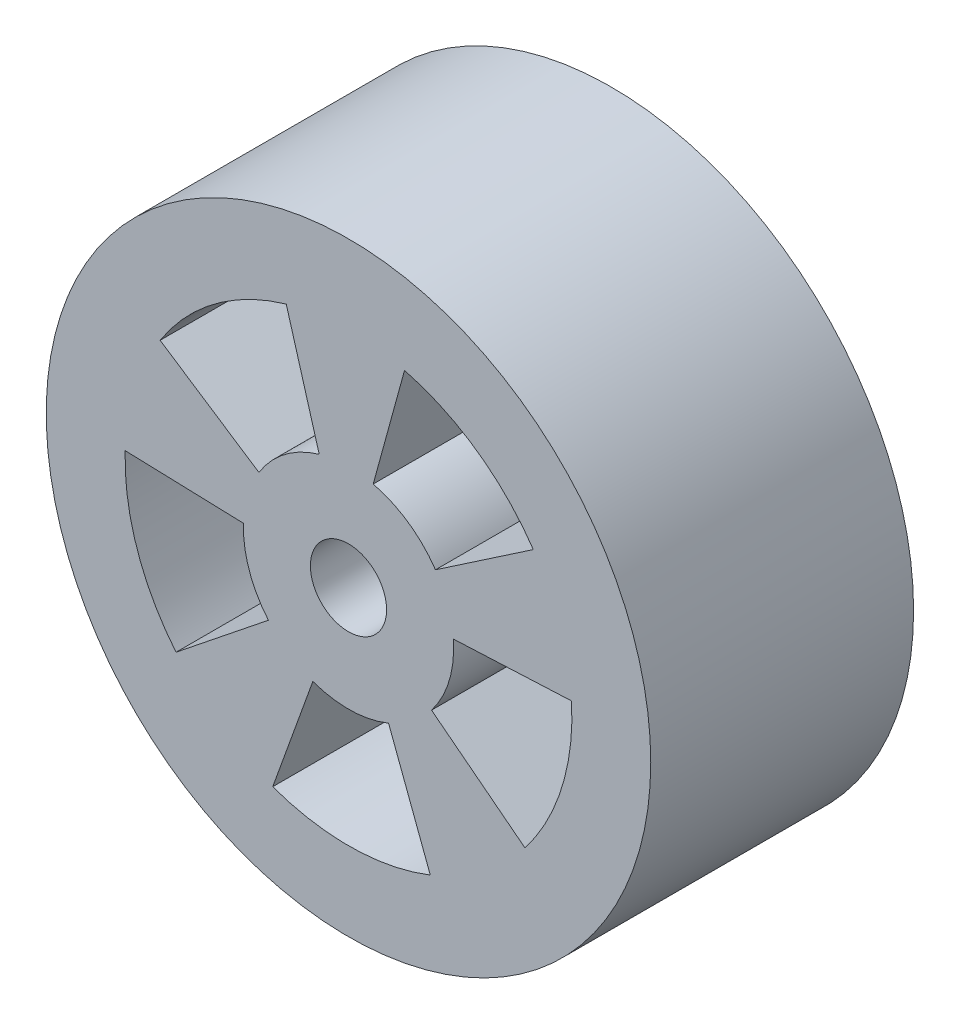
ISO-10303-21;
HEADER;
FILE_DESCRIPTION(('STEP AP214'),'2;1');
FILE_NAME('part.step','',(''),(''),'','','');
FILE_SCHEMA(('AUTOMOTIVE_DESIGN { 1 0 10303 214 1 1 1 1 }'));
ENDSEC;
DATA;
#1=APPLICATION_CONTEXT('core data for automotive mechanical design processes');
#2=APPLICATION_PROTOCOL_DEFINITION('international standard','automotive_design',2000,#1);
#3=PRODUCT_CONTEXT('',#1,'mechanical');
#4=PRODUCT('Part','Part','',(#3));
#5=PRODUCT_RELATED_PRODUCT_CATEGORY('part','',(#4));
#6=PRODUCT_DEFINITION_FORMATION('','',#4);
#7=PRODUCT_DEFINITION_CONTEXT('part definition',#1,'design');
#8=PRODUCT_DEFINITION('design','',#6,#7);
#9=PRODUCT_DEFINITION_SHAPE('','',#8);
#10=(LENGTH_UNIT() NAMED_UNIT(*) SI_UNIT(.MILLI.,.METRE.));
#11=(NAMED_UNIT(*) PLANE_ANGLE_UNIT() SI_UNIT($,.RADIAN.));
#12=(NAMED_UNIT(*) SI_UNIT($,.STERADIAN.) SOLID_ANGLE_UNIT());
#13=UNCERTAINTY_MEASURE_WITH_UNIT(LENGTH_MEASURE(1.E-05),#10,'distance_accuracy_value','');
#14=(GEOMETRIC_REPRESENTATION_CONTEXT(3) GLOBAL_UNCERTAINTY_ASSIGNED_CONTEXT((#13)) GLOBAL_UNIT_ASSIGNED_CONTEXT((#10,
#11,#12)) REPRESENTATION_CONTEXT('',''));
#15=CARTESIAN_POINT('',(0.,0.,0.));
#16=DIRECTION('',(0.,0.,1.));
#17=DIRECTION('',(1.,0.,0.));
#18=AXIS2_PLACEMENT_3D('',#15,#16,#17);
#19=CARTESIAN_POINT('',(0.,0.,0.));
#20=DIRECTION('',(0.,0.,1.));
#21=DIRECTION('',(1.,0.,0.));
#22=AXIS2_PLACEMENT_3D('',#19,#20,#21);
#23=CYLINDRICAL_SURFACE('',#22,8.5);
#24=DIRECTION('',(0.,0.,-1.));
#25=VECTOR('',#24,1.);
#26=CARTESIAN_POINT('',(8.48437143384065,0.515210027686529,10.));
#27=LINE('',#26,#25);
#28=CARTESIAN_POINT('',(8.48437143384065,0.515210027686529,10.));
#29=VERTEX_POINT('',#28);
#30=CARTESIAN_POINT('',(8.48437143384065,0.515210027686529,0.));
#31=VERTEX_POINT('',#30);
#32=EDGE_CURVE('E184',#29,#31,#27,.T.);
#33=ORIENTED_EDGE('',*,*,#32,.T.);
#34=CARTESIAN_POINT('',(0.,0.,0.));
#35=DIRECTION('',(0.,0.,1.));
#36=DIRECTION('',(1.,0.,0.));
#37=AXIS2_PLACEMENT_3D('',#34,#35,#36);
#38=CIRCLE('',#37,8.5);
#39=CARTESIAN_POINT('',(6.71424575052621,-5.21237987885963,0.));
#40=VERTEX_POINT('',#39);
#41=EDGE_CURVE('E221',#40,#31,#38,.T.);
#42=ORIENTED_EDGE('',*,*,#41,.F.);
#43=DIRECTION('',(0.,0.,-1.));
#44=VECTOR('',#43,1.);
#45=CARTESIAN_POINT('',(6.71424575052621,-5.21237987885963,10.));
#46=LINE('',#45,#44);
#47=CARTESIAN_POINT('',(6.71424575052621,-5.21237987885963,10.));
#48=VERTEX_POINT('',#47);
#49=EDGE_CURVE('E195',#48,#40,#46,.T.);
#50=ORIENTED_EDGE('',*,*,#49,.F.);
#51=CARTESIAN_POINT('',(0.,0.,10.));
#52=DIRECTION('',(0.,0.,1.));
#53=DIRECTION('',(1.,0.,0.));
#54=AXIS2_PLACEMENT_3D('',#51,#52,#53);
#55=CIRCLE('',#54,8.5);
#56=EDGE_CURVE('E177',#48,#29,#55,.T.);
#57=ORIENTED_EDGE('',*,*,#56,.T.);
#58=EDGE_LOOP('',(#33,#42,#50,#57));
#59=FACE_BOUND('',#58,.T.);
#60=ADVANCED_FACE('F33',(#59),#23,.F.);
#61=DIRECTION('',(0.,0.,-1.));
#62=VECTOR('',#61,1.);
#63=CARTESIAN_POINT('',(7.03208389051756,4.77491320933936,10.));
#64=LINE('',#63,#62);
#65=CARTESIAN_POINT('',(7.03208389051756,4.77491320933936,10.));
#66=VERTEX_POINT('',#65);
#67=CARTESIAN_POINT('',(7.03208389051755,4.77491320933936,0.));
#68=VERTEX_POINT('',#67);
#69=EDGE_CURVE('E191',#66,#68,#64,.T.);
#70=ORIENTED_EDGE('',*,*,#69,.F.);
#71=CARTESIAN_POINT('',(2.13182110555429,8.22832539305012,10.));
#72=VERTEX_POINT('',#71);
#73=EDGE_CURVE('E197',#66,#72,#55,.T.);
#74=ORIENTED_EDGE('',*,*,#73,.T.);
#75=DIRECTION('',(0.,0.,-1.));
#76=VECTOR('',#75,1.);
#77=CARTESIAN_POINT('',(2.13182110555429,8.22832539305012,10.));
#78=LINE('',#77,#76);
#79=CARTESIAN_POINT('',(2.13182110555429,8.22832539305012,0.));
#80=VERTEX_POINT('',#79);
#81=EDGE_CURVE('E318',#72,#80,#78,.T.);
#82=ORIENTED_EDGE('',*,*,#81,.T.);
#83=EDGE_CURVE('E206',#68,#80,#38,.T.);
#84=ORIENTED_EDGE('',*,*,#83,.F.);
#85=EDGE_LOOP('',(#70,#74,#82,#84));
#86=FACE_BOUND('',#85,.T.);
#87=ADVANCED_FACE('F344',(#86),#23,.F.);
#88=CARTESIAN_POINT('',(0.,0.,10.));
#89=DIRECTION('',(0.,0.,-1.));
#90=DIRECTION('',(-1.,0.,0.));
#91=AXIS2_PLACEMENT_3D('',#88,#89,#90);
#92=CYLINDRICAL_SURFACE('',#91,4.);
#93=DIRECTION('',(0.,0.,-1.));
#94=VECTOR('',#93,1.);
#95=CARTESIAN_POINT('',(3.98819234617977,0.307118559961968,10.));
#96=LINE('',#95,#94);
#97=CARTESIAN_POINT('',(3.98819234617977,0.307118559961968,10.));
#98=VERTEX_POINT('',#97);
#99=CARTESIAN_POINT('',(3.98819234617977,0.307118559961968,0.));
#100=VERTEX_POINT('',#99);
#101=EDGE_CURVE('E56',#98,#100,#96,.T.);
#102=ORIENTED_EDGE('',*,*,#101,.F.);
#103=CARTESIAN_POINT('',(0.,0.,10.));
#104=DIRECTION('',(0.,0.,1.));
#105=DIRECTION('',(1.,0.,0.));
#106=AXIS2_PLACEMENT_3D('',#103,#104,#105);
#107=CIRCLE('',#106,4.);
#108=CARTESIAN_POINT('',(3.15964505907116,-2.45288464887512,10.));
#109=VERTEX_POINT('',#108);
#110=EDGE_CURVE('E178',#109,#98,#107,.T.);
#111=ORIENTED_EDGE('',*,*,#110,.F.);
#112=DIRECTION('',(0.,0.,-1.));
#113=VECTOR('',#112,1.);
#114=CARTESIAN_POINT('',(3.15964505907116,-2.45288464887512,10.));
#115=LINE('',#114,#113);
#116=CARTESIAN_POINT('',(3.15964505907116,-2.45288464887512,0.));
#117=VERTEX_POINT('',#116);
#118=EDGE_CURVE('E252',#109,#117,#115,.T.);
#119=ORIENTED_EDGE('',*,*,#118,.T.);
#120=CARTESIAN_POINT('',(0.,0.,0.));
#121=DIRECTION('',(0.,0.,1.));
#122=DIRECTION('',(1.,0.,0.));
#123=AXIS2_PLACEMENT_3D('',#120,#121,#122);
#124=CIRCLE('',#123,4.);
#125=EDGE_CURVE('E329',#117,#100,#124,.T.);
#126=ORIENTED_EDGE('',*,*,#125,.T.);
#127=EDGE_LOOP('',(#102,#111,#119,#126));
#128=FACE_BOUND('',#127,.T.);
#129=ADVANCED_FACE('F350',(#128),#92,.T.);
#130=DIRECTION('',(0.,0.,-1.));
#131=VECTOR('',#130,1.);
#132=CARTESIAN_POINT('',(3.30921594847885,2.24701798086558,10.));
#133=LINE('',#132,#131);
#134=CARTESIAN_POINT('',(3.30921594847885,2.24701798086558,10.));
#135=VERTEX_POINT('',#134);
#136=CARTESIAN_POINT('',(3.30921594847885,2.24701798086558,0.));
#137=VERTEX_POINT('',#136);
#138=EDGE_CURVE('E327',#135,#137,#133,.T.);
#139=ORIENTED_EDGE('',*,*,#138,.T.);
#140=CARTESIAN_POINT('',(0.940332104078659,3.88790117338893,0.));
#141=VERTEX_POINT('',#140);
#142=EDGE_CURVE('E295',#137,#141,#124,.T.);
#143=ORIENTED_EDGE('',*,*,#142,.T.);
#144=DIRECTION('',(0.,0.,-1.));
#145=VECTOR('',#144,1.);
#146=CARTESIAN_POINT('',(0.940332104078659,3.88790117338893,10.));
#147=LINE('',#146,#145);
#148=CARTESIAN_POINT('',(0.940332104078659,3.88790117338893,10.));
#149=VERTEX_POINT('',#148);
#150=EDGE_CURVE('E201',#149,#141,#147,.T.);
#151=ORIENTED_EDGE('',*,*,#150,.F.);
#152=EDGE_CURVE('E48',#135,#149,#107,.T.);
#153=ORIENTED_EDGE('',*,*,#152,.F.);
#154=EDGE_LOOP('',(#139,#143,#151,#153));
#155=FACE_BOUND('',#154,.T.);
#156=ADVANCED_FACE('F325',(#155),#92,.T.);
#157=DIRECTION('',(0.,0.,-1.));
#158=VECTOR('',#157,1.);
#159=CARTESIAN_POINT('',(3.11180881373797,-7.90990808459509,10.));
#160=LINE('',#159,#158);
#161=CARTESIAN_POINT('',(3.11180881373797,-7.90990808459509,10.));
#162=VERTEX_POINT('',#161);
#163=CARTESIAN_POINT('',(3.11180881373797,-7.90990808459509,0.));
#164=VERTEX_POINT('',#163);
#165=EDGE_CURVE('E245',#162,#164,#160,.T.);
#166=ORIENTED_EDGE('',*,*,#165,.T.);
#167=CARTESIAN_POINT('',(-2.88245180787283,-7.99634113675065,0.));
#168=VERTEX_POINT('',#167);
#169=EDGE_CURVE('E220',#168,#164,#38,.T.);
#170=ORIENTED_EDGE('',*,*,#169,.F.);
#171=DIRECTION('',(0.,0.,-1.));
#172=VECTOR('',#171,1.);
#173=CARTESIAN_POINT('',(-2.88245180787283,-7.99634113675065,10.));
#174=LINE('',#173,#172);
#175=CARTESIAN_POINT('',(-2.88245180787283,-7.99634113675065,10.));
#176=VERTEX_POINT('',#175);
#177=EDGE_CURVE('E242',#176,#168,#174,.T.);
#178=ORIENTED_EDGE('',*,*,#177,.F.);
#179=EDGE_CURVE('E196',#176,#162,#55,.T.);
#180=ORIENTED_EDGE('',*,*,#179,.T.);
#181=EDGE_LOOP('',(#166,#170,#178,#180));
#182=FACE_BOUND('',#181,.T.);
#183=ADVANCED_FACE('F241',(#182),#23,.F.);
#184=DIRECTION('',(0.,0.,-1.));
#185=VECTOR('',#184,1.);
#186=CARTESIAN_POINT('',(1.52450631953265,-3.69809146475652,10.));
#187=LINE('',#186,#185);
#188=CARTESIAN_POINT('',(1.52450631953265,-3.69809146475652,10.));
#189=VERTEX_POINT('',#188);
#190=CARTESIAN_POINT('',(1.52450631953265,-3.69809146475652,0.));
#191=VERTEX_POINT('',#190);
#192=EDGE_CURVE('E248',#189,#191,#187,.T.);
#193=ORIENTED_EDGE('',*,*,#192,.F.);
#194=CARTESIAN_POINT('',(-1.35644790958722,-3.76298406435325,10.));
#195=VERTEX_POINT('',#194);
#196=EDGE_CURVE('E502',#195,#189,#107,.T.);
#197=ORIENTED_EDGE('',*,*,#196,.F.);
#198=DIRECTION('',(0.,0.,-1.));
#199=VECTOR('',#198,1.);
#200=CARTESIAN_POINT('',(-1.35644790958722,-3.76298406435325,10.));
#201=LINE('',#200,#199);
#202=CARTESIAN_POINT('',(-1.35644790958722,-3.76298406435325,0.));
#203=VERTEX_POINT('',#202);
#204=EDGE_CURVE('E261',#195,#203,#201,.T.);
#205=ORIENTED_EDGE('',*,*,#204,.T.);
#206=EDGE_CURVE('E489',#203,#191,#124,.T.);
#207=ORIENTED_EDGE('',*,*,#206,.T.);
#208=EDGE_LOOP('',(#193,#197,#205,#207));
#209=FACE_BOUND('',#208,.T.);
#210=ADVANCED_FACE('F364',(#209),#92,.T.);
#211=DIRECTION('',(0.,0.,-1.));
#212=VECTOR('',#211,1.);
#213=CARTESIAN_POINT('',(-6.56116782045911,-5.40380207185384,10.));
#214=LINE('',#213,#212);
#215=CARTESIAN_POINT('',(-6.56116782045911,-5.40380207185384,10.));
#216=VERTEX_POINT('',#215);
#217=CARTESIAN_POINT('',(-6.56116782045911,-5.40380207185384,0.));
#218=VERTEX_POINT('',#217);
#219=EDGE_CURVE('E267',#216,#218,#214,.T.);
#220=ORIENTED_EDGE('',*,*,#219,.T.);
#221=CARTESIAN_POINT('',(-8.4956989387252,0.270369270708785,0.));
#222=VERTEX_POINT('',#221);
#223=EDGE_CURVE('E215',#222,#218,#38,.T.);
#224=ORIENTED_EDGE('',*,*,#223,.F.);
#225=DIRECTION('',(0.,0.,-1.));
#226=VECTOR('',#225,1.);
#227=CARTESIAN_POINT('',(-8.4956989387252,0.270369270708786,10.));
#228=LINE('',#227,#226);
#229=CARTESIAN_POINT('',(-8.4956989387252,0.270369270708786,10.));
#230=VERTEX_POINT('',#229);
#231=EDGE_CURVE('E286',#230,#222,#228,.T.);
#232=ORIENTED_EDGE('',*,*,#231,.F.);
#233=EDGE_CURVE('E200',#230,#216,#55,.T.);
#234=ORIENTED_EDGE('',*,*,#233,.T.);
#235=EDGE_LOOP('',(#220,#224,#232,#234));
#236=FACE_BOUND('',#235,.T.);
#237=ADVANCED_FACE('F356',(#236),#23,.F.);
#238=DIRECTION('',(0.,0.,-1.));
#239=VECTOR('',#238,1.);
#240=CARTESIAN_POINT('',(-3.04599562464459,-2.59266477868737,10.));
#241=LINE('',#240,#239);
#242=CARTESIAN_POINT('',(-3.04599562464459,-2.59266477868737,10.));
#243=VERTEX_POINT('',#242);
#244=CARTESIAN_POINT('',(-3.04599562464459,-2.59266477868737,0.));
#245=VERTEX_POINT('',#244);
#246=EDGE_CURVE('E270',#243,#245,#241,.T.);
#247=ORIENTED_EDGE('',*,*,#246,.F.);
#248=CARTESIAN_POINT('',(-3.9979759711648,0.127232597980605,10.));
#249=VERTEX_POINT('',#248);
#250=EDGE_CURVE('E300',#249,#243,#107,.T.);
#251=ORIENTED_EDGE('',*,*,#250,.F.);
#252=DIRECTION('',(0.,0.,-1.));
#253=VECTOR('',#252,1.);
#254=CARTESIAN_POINT('',(-3.9979759711648,0.127232597980605,10.));
#255=LINE('',#254,#253);
#256=CARTESIAN_POINT('',(-3.9979759711648,0.127232597980605,0.));
#257=VERTEX_POINT('',#256);
#258=EDGE_CURVE('E280',#249,#257,#255,.T.);
#259=ORIENTED_EDGE('',*,*,#258,.T.);
#260=EDGE_CURVE('E303',#257,#245,#124,.T.);
#261=ORIENTED_EDGE('',*,*,#260,.T.);
#262=EDGE_LOOP('',(#247,#251,#259,#261));
#263=FACE_BOUND('',#262,.T.);
#264=ADVANCED_FACE('F354',(#263),#92,.T.);
#265=DIRECTION('',(0.,0.,-1.));
#266=VECTOR('',#265,1.);
#267=CARTESIAN_POINT('',(-7.16683353267374,4.57017473571233,10.));
#268=LINE('',#267,#266);
#269=CARTESIAN_POINT('',(-7.16683353267374,4.57017473571233,10.));
#270=VERTEX_POINT('',#269);
#271=CARTESIAN_POINT('',(-7.16683353267374,4.57017473571233,0.));
#272=VERTEX_POINT('',#271);
#273=EDGE_CURVE('E289',#270,#272,#268,.T.);
#274=ORIENTED_EDGE('',*,*,#273,.T.);
#275=CARTESIAN_POINT('',(-2.36817889444572,8.1634385355622,0.));
#276=VERTEX_POINT('',#275);
#277=EDGE_CURVE('E207',#276,#272,#38,.T.);
#278=ORIENTED_EDGE('',*,*,#277,.F.);
#279=DIRECTION('',(0.,0.,-1.));
#280=VECTOR('',#279,1.);
#281=CARTESIAN_POINT('',(-2.36817889444572,8.1634385355622,10.));
#282=LINE('',#281,#280);
#283=CARTESIAN_POINT('',(-2.36817889444572,8.1634385355622,10.));
#284=VERTEX_POINT('',#283);
#285=EDGE_CURVE('E315',#284,#276,#282,.T.);
#286=ORIENTED_EDGE('',*,*,#285,.F.);
#287=EDGE_CURVE('E202',#284,#270,#55,.T.);
#288=ORIENTED_EDGE('',*,*,#287,.T.);
#289=EDGE_LOOP('',(#274,#278,#286,#288));
#290=FACE_BOUND('',#289,.T.);
#291=ADVANCED_FACE('F346',(#290),#23,.F.);
#292=DIRECTION('',(0.,0.,-1.));
#293=VECTOR('',#292,1.);
#294=CARTESIAN_POINT('',(-3.40703514514646,2.09573651009301,10.));
#295=LINE('',#294,#293);
#296=CARTESIAN_POINT('',(-3.40703514514646,2.09573651009301,10.));
#297=VERTEX_POINT('',#296);
#298=CARTESIAN_POINT('',(-3.40703514514646,2.09573651009301,0.));
#299=VERTEX_POINT('',#298);
#300=EDGE_CURVE('E292',#297,#299,#295,.T.);
#301=ORIENTED_EDGE('',*,*,#300,.F.);
#302=CARTESIAN_POINT('',(-1.11443712679798,3.84161813438221,10.));
#303=VERTEX_POINT('',#302);
#304=EDGE_CURVE('E296',#303,#297,#107,.T.);
#305=ORIENTED_EDGE('',*,*,#304,.F.);
#306=DIRECTION('',(0.,0.,-1.));
#307=VECTOR('',#306,1.);
#308=CARTESIAN_POINT('',(-1.11443712679798,3.84161813438221,10.));
#309=LINE('',#308,#307);
#310=CARTESIAN_POINT('',(-1.11443712679798,3.84161813438221,0.));
#311=VERTEX_POINT('',#310);
#312=EDGE_CURVE('E310',#303,#311,#309,.T.);
#313=ORIENTED_EDGE('',*,*,#312,.T.);
#314=EDGE_CURVE('E301',#311,#299,#124,.T.);
#315=ORIENTED_EDGE('',*,*,#314,.T.);
#316=EDGE_LOOP('',(#301,#305,#313,#315));
#317=FACE_BOUND('',#316,.T.);
#318=ADVANCED_FACE('F353',(#317),#92,.T.);
#319=CARTESIAN_POINT('',(0.,0.,10.));
#320=DIRECTION('',(0.,0.,-1.));
#321=DIRECTION('',(-1.,0.,0.));
#322=AXIS2_PLACEMENT_3D('',#319,#320,#321);
#323=CYLINDRICAL_SURFACE('',#322,11.5);
#324=CARTESIAN_POINT('',(0.,0.,10.));
#325=DIRECTION('',(0.,0.,1.));
#326=DIRECTION('',(1.,0.,0.));
#327=AXIS2_PLACEMENT_3D('',#324,#325,#326);
#328=CIRCLE('',#327,11.5);
#329=CARTESIAN_POINT('',(11.5,0.,10.));
#330=VERTEX_POINT('',#329);
#331=EDGE_CURVE('E41',#330,#330,#328,.T.);
#332=ORIENTED_EDGE('',*,*,#331,.F.);
#333=EDGE_LOOP('',(#332));
#334=FACE_BOUND('',#333,.T.);
#335=CARTESIAN_POINT('',(0.,0.,0.));
#336=DIRECTION('',(0.,0.,1.));
#337=DIRECTION('',(1.,0.,0.));
#338=AXIS2_PLACEMENT_3D('',#335,#336,#337);
#339=CIRCLE('',#338,11.5);
#340=CARTESIAN_POINT('',(11.5,0.,0.));
#341=VERTEX_POINT('',#340);
#342=EDGE_CURVE('E210',#341,#341,#339,.T.);
#343=ORIENTED_EDGE('',*,*,#342,.T.);
#344=EDGE_LOOP('',(#343));
#345=FACE_BOUND('',#344,.T.);
#346=ADVANCED_FACE('F340',(#334,#345),#323,.T.);
#347=CARTESIAN_POINT('',(0.,0.,10.));
#348=DIRECTION('',(0.,0.,1.));
#349=DIRECTION('',(1.,0.,0.));
#350=AXIS2_PLACEMENT_3D('',#347,#348,#349);
#351=PLANE('',#350);
#352=CARTESIAN_POINT('',(0.,0.,10.));
#353=DIRECTION('',(0.,0.,1.));
#354=DIRECTION('',(1.,0.,0.));
#355=AXIS2_PLACEMENT_3D('',#352,#353,#354);
#356=CIRCLE('',#355,1.45);
#357=CARTESIAN_POINT('',(1.45,0.,10.));
#358=VERTEX_POINT('',#357);
#359=EDGE_CURVE('E463',#358,#358,#356,.T.);
#360=ORIENTED_EDGE('',*,*,#359,.F.);
#361=EDGE_LOOP('',(#360));
#362=FACE_BOUND('',#361,.T.);
#363=ORIENTED_EDGE('',*,*,#110,.T.);
#364=DIRECTION('',(0.998930712880404,0.0462323573295585,0.));
#365=VECTOR('',#364,1.);
#366=CARTESIAN_POINT('',(3.98819234617977,0.307118559961968,10.));
#367=LINE('',#366,#365);
#368=EDGE_CURVE('E171',#98,#29,#367,.T.);
#369=ORIENTED_EDGE('',*,*,#368,.T.);
#370=ORIENTED_EDGE('',*,*,#56,.F.);
#371=DIRECTION('',(-0.78991126476779,0.61322116221878,0.));
#372=VECTOR('',#371,1.);
#373=CARTESIAN_POINT('',(3.15964505907116,-2.45288464887512,10.));
#374=LINE('',#373,#372);
#375=EDGE_CURVE('E480',#48,#109,#374,.T.);
#376=ORIENTED_EDGE('',*,*,#375,.T.);
#377=EDGE_LOOP('',(#363,#369,#370,#376));
#378=FACE_BOUND('',#377,.T.);
#379=ORIENTED_EDGE('',*,*,#196,.T.);
#380=DIRECTION('',(0.352656151185087,-0.935752979707423,0.));
#381=VECTOR('',#380,1.);
#382=CARTESIAN_POINT('',(1.52450631953265,-3.69809146475652,10.));
#383=LINE('',#382,#381);
#384=EDGE_CURVE('E478',#189,#162,#383,.T.);
#385=ORIENTED_EDGE('',*,*,#384,.T.);
#386=ORIENTED_EDGE('',*,*,#179,.F.);
#387=DIRECTION('',(0.339111977396804,0.940746016088311,0.));
#388=VECTOR('',#387,1.);
#389=CARTESIAN_POINT('',(-1.35644790958722,-3.76298406435325,10.));
#390=LINE('',#389,#388);
#391=EDGE_CURVE('E258',#176,#195,#390,.T.);
#392=ORIENTED_EDGE('',*,*,#391,.T.);
#393=EDGE_LOOP('',(#379,#385,#386,#392));
#394=FACE_BOUND('',#393,.T.);
#395=ORIENTED_EDGE('',*,*,#250,.T.);
#396=DIRECTION('',(-0.7809772251063,-0.624559503862733,0.));
#397=VECTOR('',#396,1.);
#398=CARTESIAN_POINT('',(-3.04599562464459,-2.59266477868737,10.));
#399=LINE('',#398,#397);
#400=EDGE_CURVE('E256',#243,#216,#399,.T.);
#401=ORIENTED_EDGE('',*,*,#400,.T.);
#402=ORIENTED_EDGE('',*,*,#233,.F.);
#403=DIRECTION('',(0.999493992791199,-0.0318081494951512,0.));
#404=VECTOR('',#403,1.);
#405=CARTESIAN_POINT('',(-3.9979759711648,0.127232597980605,10.));
#406=LINE('',#405,#404);
#407=EDGE_CURVE('E276',#230,#249,#406,.T.);
#408=ORIENTED_EDGE('',*,*,#407,.T.);
#409=EDGE_LOOP('',(#395,#401,#402,#408));
#410=FACE_BOUND('',#409,.T.);
#411=DIRECTION('',(-0.827303987119713,-0.561754495216395,0.));
#412=VECTOR('',#411,1.);
#413=CARTESIAN_POINT('',(3.30921594847885,2.24701798086558,10.));
#414=LINE('',#413,#412);
#415=EDGE_CURVE('E180',#66,#135,#414,.T.);
#416=ORIENTED_EDGE('',*,*,#415,.T.);
#417=ORIENTED_EDGE('',*,*,#152,.T.);
#418=DIRECTION('',(0.264716981781171,0.964326147917118,0.));
#419=VECTOR('',#418,1.);
#420=CARTESIAN_POINT('',(0.940332104078659,3.88790117338893,10.));
#421=LINE('',#420,#419);
#422=EDGE_CURVE('E304',#149,#72,#421,.T.);
#423=ORIENTED_EDGE('',*,*,#422,.T.);
#424=ORIENTED_EDGE('',*,*,#73,.F.);
#425=EDGE_LOOP('',(#416,#417,#423,#424));
#426=FACE_BOUND('',#425,.T.);
#427=ORIENTED_EDGE('',*,*,#287,.F.);
#428=DIRECTION('',(0.278609281699496,-0.960404533595553,0.));
#429=VECTOR('',#428,1.);
#430=CARTESIAN_POINT('',(-1.11443712679798,3.84161813438221,10.));
#431=LINE('',#430,#429);
#432=EDGE_CURVE('E307',#284,#303,#431,.T.);
#433=ORIENTED_EDGE('',*,*,#432,.T.);
#434=ORIENTED_EDGE('',*,*,#304,.T.);
#435=DIRECTION('',(-0.835326620740355,0.549753978323485,0.));
#436=VECTOR('',#435,1.);
#437=CARTESIAN_POINT('',(-3.40703514514646,2.09573651009301,10.));
#438=LINE('',#437,#436);
#439=EDGE_CURVE('E274',#297,#270,#438,.T.);
#440=ORIENTED_EDGE('',*,*,#439,.T.);
#441=EDGE_LOOP('',(#427,#433,#434,#440));
#442=FACE_BOUND('',#441,.T.);
#443=ORIENTED_EDGE('',*,*,#331,.T.);
#444=EDGE_LOOP('',(#443));
#445=FACE_BOUND('',#444,.T.);
#446=ADVANCED_FACE('F173',(#362,#378,#394,#410,#426,#442,#445),#351,.T.);
#447=CARTESIAN_POINT('',(0.,0.,0.));
#448=DIRECTION('',(0.,0.,1.));
#449=DIRECTION('',(1.,0.,0.));
#450=AXIS2_PLACEMENT_3D('',#447,#448,#449);
#451=PLANE('',#450);
#452=CARTESIAN_POINT('',(0.,0.,0.));
#453=DIRECTION('',(0.,0.,1.));
#454=DIRECTION('',(1.,0.,0.));
#455=AXIS2_PLACEMENT_3D('',#452,#453,#454);
#456=CIRCLE('',#455,3.98606797749979);
#457=CARTESIAN_POINT('',(3.98606797749979,0.,0.));
#458=VERTEX_POINT('',#457);
#459=EDGE_CURVE('E11',#458,#458,#456,.T.);
#460=ORIENTED_EDGE('',*,*,#459,.T.);
#461=EDGE_LOOP('',(#460));
#462=FACE_BOUND('',#461,.T.);
#463=DIRECTION('',(0.998930712880404,0.0462323573295585,0.));
#464=VECTOR('',#463,1.);
#465=CARTESIAN_POINT('',(3.98819234617977,0.307118559961968,0.));
#466=LINE('',#465,#464);
#467=EDGE_CURVE('E187',#100,#31,#466,.T.);
#468=ORIENTED_EDGE('',*,*,#467,.F.);
#469=ORIENTED_EDGE('',*,*,#125,.F.);
#470=DIRECTION('',(-0.78991126476779,0.61322116221878,0.));
#471=VECTOR('',#470,1.);
#472=CARTESIAN_POINT('',(3.15964505907116,-2.45288464887512,0.));
#473=LINE('',#472,#471);
#474=EDGE_CURVE('E481',#40,#117,#473,.T.);
#475=ORIENTED_EDGE('',*,*,#474,.F.);
#476=ORIENTED_EDGE('',*,*,#41,.T.);
#477=EDGE_LOOP('',(#468,#469,#475,#476));
#478=FACE_BOUND('',#477,.T.);
#479=DIRECTION('',(0.352656151185087,-0.935752979707423,0.));
#480=VECTOR('',#479,1.);
#481=CARTESIAN_POINT('',(1.52450631953265,-3.69809146475652,0.));
#482=LINE('',#481,#480);
#483=EDGE_CURVE('E233',#191,#164,#482,.T.);
#484=ORIENTED_EDGE('',*,*,#483,.F.);
#485=ORIENTED_EDGE('',*,*,#206,.F.);
#486=DIRECTION('',(0.339111977396804,0.940746016088311,0.));
#487=VECTOR('',#486,1.);
#488=CARTESIAN_POINT('',(-1.35644790958722,-3.76298406435325,0.));
#489=LINE('',#488,#487);
#490=EDGE_CURVE('E236',#168,#203,#489,.T.);
#491=ORIENTED_EDGE('',*,*,#490,.F.);
#492=ORIENTED_EDGE('',*,*,#169,.T.);
#493=EDGE_LOOP('',(#484,#485,#491,#492));
#494=FACE_BOUND('',#493,.T.);
#495=DIRECTION('',(-0.7809772251063,-0.624559503862733,0.));
#496=VECTOR('',#495,1.);
#497=CARTESIAN_POINT('',(-3.04599562464459,-2.59266477868737,0.));
#498=LINE('',#497,#496);
#499=EDGE_CURVE('E250',#245,#218,#498,.T.);
#500=ORIENTED_EDGE('',*,*,#499,.F.);
#501=ORIENTED_EDGE('',*,*,#260,.F.);
#502=DIRECTION('',(0.999493992791199,-0.0318081494951512,0.));
#503=VECTOR('',#502,1.);
#504=CARTESIAN_POINT('',(-3.9979759711648,0.127232597980605,0.));
#505=LINE('',#504,#503);
#506=EDGE_CURVE('E277',#222,#257,#505,.T.);
#507=ORIENTED_EDGE('',*,*,#506,.F.);
#508=ORIENTED_EDGE('',*,*,#223,.T.);
#509=EDGE_LOOP('',(#500,#501,#507,#508));
#510=FACE_BOUND('',#509,.T.);
#511=ORIENTED_EDGE('',*,*,#142,.F.);
#512=DIRECTION('',(-0.827303987119713,-0.561754495216395,0.));
#513=VECTOR('',#512,1.);
#514=CARTESIAN_POINT('',(3.30921594847885,2.24701798086558,0.));
#515=LINE('',#514,#513);
#516=EDGE_CURVE('E181',#68,#137,#515,.T.);
#517=ORIENTED_EDGE('',*,*,#516,.F.);
#518=ORIENTED_EDGE('',*,*,#83,.T.);
#519=DIRECTION('',(0.264716981781171,0.964326147917118,0.));
#520=VECTOR('',#519,1.);
#521=CARTESIAN_POINT('',(0.940332104078659,3.88790117338893,0.));
#522=LINE('',#521,#520);
#523=EDGE_CURVE('E299',#141,#80,#522,.T.);
#524=ORIENTED_EDGE('',*,*,#523,.F.);
#525=EDGE_LOOP('',(#511,#517,#518,#524));
#526=FACE_BOUND('',#525,.T.);
#527=ORIENTED_EDGE('',*,*,#277,.T.);
#528=DIRECTION('',(-0.835326620740355,0.549753978323485,0.));
#529=VECTOR('',#528,1.);
#530=CARTESIAN_POINT('',(-3.40703514514646,2.09573651009301,0.));
#531=LINE('',#530,#529);
#532=EDGE_CURVE('E273',#299,#272,#531,.T.);
#533=ORIENTED_EDGE('',*,*,#532,.F.);
#534=ORIENTED_EDGE('',*,*,#314,.F.);
#535=DIRECTION('',(0.278609281699496,-0.960404533595553,0.));
#536=VECTOR('',#535,1.);
#537=CARTESIAN_POINT('',(-1.11443712679798,3.84161813438221,0.));
#538=LINE('',#537,#536);
#539=EDGE_CURVE('E308',#276,#311,#538,.T.);
#540=ORIENTED_EDGE('',*,*,#539,.F.);
#541=EDGE_LOOP('',(#527,#533,#534,#540));
#542=FACE_BOUND('',#541,.T.);
#543=ORIENTED_EDGE('',*,*,#342,.F.);
#544=EDGE_LOOP('',(#543));
#545=FACE_BOUND('',#544,.T.);
#546=ADVANCED_FACE('F231',(#462,#478,#494,#510,#526,#542,#545),#451,.F.);
#547=CARTESIAN_POINT('',(0.940332104078659,3.88790117338893,10.));
#548=DIRECTION('',(-0.964326147917118,0.264716981781171,0.));
#549=DIRECTION('',(-0.264716981781171,-0.964326147917118,0.));
#550=AXIS2_PLACEMENT_3D('',#547,#548,#549);
#551=PLANE('',#550);
#552=ORIENTED_EDGE('',*,*,#523,.T.);
#553=ORIENTED_EDGE('',*,*,#81,.F.);
#554=ORIENTED_EDGE('',*,*,#422,.F.);
#555=ORIENTED_EDGE('',*,*,#150,.T.);
#556=EDGE_LOOP('',(#552,#553,#554,#555));
#557=FACE_BOUND('',#556,.T.);
#558=ADVANCED_FACE('F323',(#557),#551,.F.);
#559=CARTESIAN_POINT('',(-1.11443712679798,3.84161813438221,10.));
#560=DIRECTION('',(0.960404533595553,0.278609281699496,0.));
#561=DIRECTION('',(-0.278609281699496,0.960404533595553,0.));
#562=AXIS2_PLACEMENT_3D('',#559,#560,#561);
#563=PLANE('',#562);
#564=ORIENTED_EDGE('',*,*,#539,.T.);
#565=ORIENTED_EDGE('',*,*,#312,.F.);
#566=ORIENTED_EDGE('',*,*,#432,.F.);
#567=ORIENTED_EDGE('',*,*,#285,.T.);
#568=EDGE_LOOP('',(#564,#565,#566,#567));
#569=FACE_BOUND('',#568,.T.);
#570=ADVANCED_FACE('F338',(#569),#563,.F.);
#571=CARTESIAN_POINT('',(-3.40703514514646,2.09573651009301,10.));
#572=DIRECTION('',(-0.549753978323485,-0.835326620740355,0.));
#573=DIRECTION('',(0.835326620740355,-0.549753978323485,0.));
#574=AXIS2_PLACEMENT_3D('',#571,#572,#573);
#575=PLANE('',#574);
#576=ORIENTED_EDGE('',*,*,#532,.T.);
#577=ORIENTED_EDGE('',*,*,#273,.F.);
#578=ORIENTED_EDGE('',*,*,#439,.F.);
#579=ORIENTED_EDGE('',*,*,#300,.T.);
#580=EDGE_LOOP('',(#576,#577,#578,#579));
#581=FACE_BOUND('',#580,.T.);
#582=ADVANCED_FACE('F380',(#581),#575,.F.);
#583=CARTESIAN_POINT('',(-3.9979759711648,0.127232597980605,10.));
#584=DIRECTION('',(0.0318081494951512,0.9994939927912,0.));
#585=DIRECTION('',(-0.9994939927912,0.0318081494951512,0.));
#586=AXIS2_PLACEMENT_3D('',#583,#584,#585);
#587=PLANE('',#586);
#588=ORIENTED_EDGE('',*,*,#506,.T.);
#589=ORIENTED_EDGE('',*,*,#258,.F.);
#590=ORIENTED_EDGE('',*,*,#407,.F.);
#591=ORIENTED_EDGE('',*,*,#231,.T.);
#592=EDGE_LOOP('',(#588,#589,#590,#591));
#593=FACE_BOUND('',#592,.T.);
#594=ADVANCED_FACE('F387',(#593),#587,.F.);
#595=CARTESIAN_POINT('',(-3.04599562464459,-2.59266477868737,10.));
#596=DIRECTION('',(0.624559503862733,-0.7809772251063,0.));
#597=DIRECTION('',(0.7809772251063,0.624559503862733,0.));
#598=AXIS2_PLACEMENT_3D('',#595,#596,#597);
#599=PLANE('',#598);
#600=ORIENTED_EDGE('',*,*,#499,.T.);
#601=ORIENTED_EDGE('',*,*,#219,.F.);
#602=ORIENTED_EDGE('',*,*,#400,.F.);
#603=ORIENTED_EDGE('',*,*,#246,.T.);
#604=EDGE_LOOP('',(#600,#601,#602,#603));
#605=FACE_BOUND('',#604,.T.);
#606=ADVANCED_FACE('F497',(#605),#599,.F.);
#607=CARTESIAN_POINT('',(-1.35644790958722,-3.76298406435325,10.));
#608=DIRECTION('',(-0.940746016088312,0.339111977396804,0.));
#609=DIRECTION('',(-0.339111977396804,-0.940746016088312,0.));
#610=AXIS2_PLACEMENT_3D('',#607,#608,#609);
#611=PLANE('',#610);
#612=ORIENTED_EDGE('',*,*,#490,.T.);
#613=ORIENTED_EDGE('',*,*,#204,.F.);
#614=ORIENTED_EDGE('',*,*,#391,.F.);
#615=ORIENTED_EDGE('',*,*,#177,.T.);
#616=EDGE_LOOP('',(#612,#613,#614,#615));
#617=FACE_BOUND('',#616,.T.);
#618=ADVANCED_FACE('F517',(#617),#611,.F.);
#619=CARTESIAN_POINT('',(1.52450631953265,-3.69809146475652,10.));
#620=DIRECTION('',(0.935752979707423,0.352656151185087,0.));
#621=DIRECTION('',(-0.352656151185087,0.935752979707423,0.));
#622=AXIS2_PLACEMENT_3D('',#619,#620,#621);
#623=PLANE('',#622);
#624=ORIENTED_EDGE('',*,*,#483,.T.);
#625=ORIENTED_EDGE('',*,*,#165,.F.);
#626=ORIENTED_EDGE('',*,*,#384,.F.);
#627=ORIENTED_EDGE('',*,*,#192,.T.);
#628=EDGE_LOOP('',(#624,#625,#626,#627));
#629=FACE_BOUND('',#628,.T.);
#630=ADVANCED_FACE('F514',(#629),#623,.F.);
#631=CARTESIAN_POINT('',(3.15964505907116,-2.45288464887512,10.));
#632=DIRECTION('',(-0.61322116221878,-0.78991126476779,0.));
#633=DIRECTION('',(0.78991126476779,-0.61322116221878,0.));
#634=AXIS2_PLACEMENT_3D('',#631,#632,#633);
#635=PLANE('',#634);
#636=ORIENTED_EDGE('',*,*,#474,.T.);
#637=ORIENTED_EDGE('',*,*,#118,.F.);
#638=ORIENTED_EDGE('',*,*,#375,.F.);
#639=ORIENTED_EDGE('',*,*,#49,.T.);
#640=EDGE_LOOP('',(#636,#637,#638,#639));
#641=FACE_BOUND('',#640,.T.);
#642=ADVANCED_FACE('F488',(#641),#635,.F.);
#643=CARTESIAN_POINT('',(3.98819234617977,0.307118559961968,10.));
#644=DIRECTION('',(-0.0462323573295585,0.998930712880404,0.));
#645=DIRECTION('',(-0.998930712880404,-0.0462323573295585,0.));
#646=AXIS2_PLACEMENT_3D('',#643,#644,#645);
#647=PLANE('',#646);
#648=ORIENTED_EDGE('',*,*,#467,.T.);
#649=ORIENTED_EDGE('',*,*,#32,.F.);
#650=ORIENTED_EDGE('',*,*,#368,.F.);
#651=ORIENTED_EDGE('',*,*,#101,.T.);
#652=EDGE_LOOP('',(#648,#649,#650,#651));
#653=FACE_BOUND('',#652,.T.);
#654=ADVANCED_FACE('F185',(#653),#647,.F.);
#655=CARTESIAN_POINT('',(3.30921594847885,2.24701798086558,10.));
#656=DIRECTION('',(0.561754495216395,-0.827303987119713,0.));
#657=DIRECTION('',(0.827303987119712,0.561754495216395,0.));
#658=AXIS2_PLACEMENT_3D('',#655,#656,#657);
#659=PLANE('',#658);
#660=ORIENTED_EDGE('',*,*,#516,.T.);
#661=ORIENTED_EDGE('',*,*,#138,.F.);
#662=ORIENTED_EDGE('',*,*,#415,.F.);
#663=ORIENTED_EDGE('',*,*,#69,.T.);
#664=EDGE_LOOP('',(#660,#661,#662,#663));
#665=FACE_BOUND('',#664,.T.);
#666=ADVANCED_FACE('F418',(#665),#659,.F.);
#667=CARTESIAN_POINT('',(0.,0.,0.));
#668=DIRECTION('',(0.,0.,1.));
#669=DIRECTION('',(1.,0.,0.));
#670=AXIS2_PLACEMENT_3D('',#667,#668,#669);
#671=CYLINDRICAL_SURFACE('',#670,1.45);
#672=ORIENTED_EDGE('',*,*,#359,.T.);
#673=EDGE_LOOP('',(#672));
#674=FACE_BOUND('',#673,.T.);
#675=CARTESIAN_POINT('',(0.,0.,-2.));
#676=DIRECTION('',(0.,0.,-1.));
#677=DIRECTION('',(-1.,0.,0.));
#678=AXIS2_PLACEMENT_3D('',#675,#676,#677);
#679=CIRCLE('',#678,1.45);
#680=CARTESIAN_POINT('',(-1.45,0.,-2.));
#681=VERTEX_POINT('',#680);
#682=EDGE_CURVE('E464',#681,#681,#679,.T.);
#683=ORIENTED_EDGE('',*,*,#682,.T.);
#684=EDGE_LOOP('',(#683));
#685=FACE_BOUND('',#684,.T.);
#686=ADVANCED_FACE('F423',(#674,#685),#671,.F.);
#687=CARTESIAN_POINT('',(0.,0.,-2.));
#688=DIRECTION('',(0.,0.,-1.));
#689=DIRECTION('',(-1.,0.,0.));
#690=AXIS2_PLACEMENT_3D('',#687,#688,#689);
#691=PLANE('',#690);
#692=ORIENTED_EDGE('',*,*,#682,.F.);
#693=EDGE_LOOP('',(#692));
#694=FACE_BOUND('',#693,.T.);
#695=CARTESIAN_POINT('',(0.,0.,-2.));
#696=DIRECTION('',(0.,0.,-1.));
#697=DIRECTION('',(-1.,0.,0.));
#698=AXIS2_PLACEMENT_3D('',#695,#696,#697);
#699=CIRCLE('',#698,1.75);
#700=CARTESIAN_POINT('',(-1.75,0.,-2.));
#701=VERTEX_POINT('',#700);
#702=EDGE_CURVE('E461',#701,#701,#699,.T.);
#703=ORIENTED_EDGE('',*,*,#702,.T.);
#704=EDGE_LOOP('',(#703));
#705=FACE_BOUND('',#704,.T.);
#706=ADVANCED_FACE('F428',(#694,#705),#691,.T.);
#707=CARTESIAN_POINT('',(0.,0.,-2.25));
#708=DIRECTION('',(0.,0.,1.));
#709=DIRECTION('',(1.,0.,0.));
#710=AXIS2_PLACEMENT_3D('',#707,#708,#709);
#711=TOROIDAL_SURFACE('',#710,3.98606797749979,2.25);
#712=ORIENTED_EDGE('',*,*,#459,.F.);
#713=EDGE_LOOP('',(#712));
#714=FACE_BOUND('',#713,.T.);
#715=ORIENTED_EDGE('',*,*,#702,.F.);
#716=EDGE_LOOP('',(#715));
#717=FACE_BOUND('',#716,.T.);
#718=ADVANCED_FACE('F35',(#714,#717),#711,.F.);
#719=CLOSED_SHELL('',(#60,#87,#129,#156,#183,#210,#237,#264,#291,#318,#346,#446,#546,#558,#570,
#582,#594,#606,#618,#630,#642,#654,#666,#686,#706,#718));
#720=MANIFOLD_SOLID_BREP('B2',#719);
#721=ADVANCED_BREP_SHAPE_REPRESENTATION('',(#18,#720),#14);
#722=SHAPE_DEFINITION_REPRESENTATION(#9,#721);
ENDSEC;
END-ISO-10303-21;
